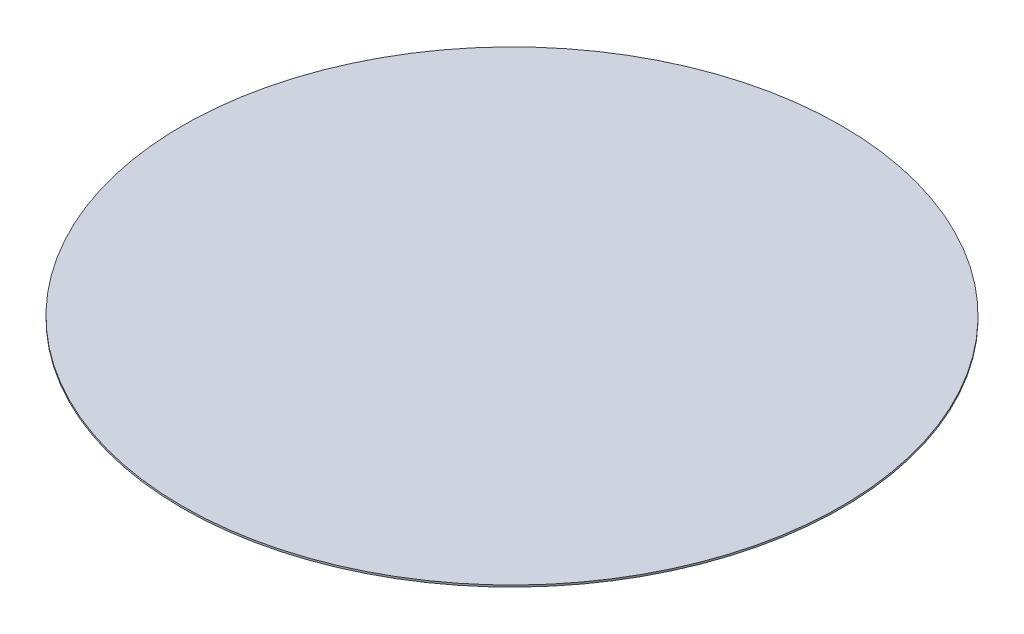
ISO-10303-21;
HEADER;
FILE_DESCRIPTION(('STEP AP214'),'2;1');
FILE_NAME('part.step','',(''),(''),'','','');
FILE_SCHEMA(('AUTOMOTIVE_DESIGN { 1 0 10303 214 1 1 1 1 }'));
ENDSEC;
DATA;
#1=APPLICATION_CONTEXT('core data for automotive mechanical design processes');
#2=APPLICATION_PROTOCOL_DEFINITION('international standard','automotive_design',2000,#1);
#3=PRODUCT_CONTEXT('',#1,'mechanical');
#4=PRODUCT('Part','Part','',(#3));
#5=PRODUCT_RELATED_PRODUCT_CATEGORY('part','',(#4));
#6=PRODUCT_DEFINITION_FORMATION('','',#4);
#7=PRODUCT_DEFINITION_CONTEXT('part definition',#1,'design');
#8=PRODUCT_DEFINITION('design','',#6,#7);
#9=PRODUCT_DEFINITION_SHAPE('','',#8);
#10=(LENGTH_UNIT() NAMED_UNIT(*) SI_UNIT(.MILLI.,.METRE.));
#11=(NAMED_UNIT(*) PLANE_ANGLE_UNIT() SI_UNIT($,.RADIAN.));
#12=(NAMED_UNIT(*) SI_UNIT($,.STERADIAN.) SOLID_ANGLE_UNIT());
#13=UNCERTAINTY_MEASURE_WITH_UNIT(LENGTH_MEASURE(1.E-05),#10,'distance_accuracy_value','');
#14=(GEOMETRIC_REPRESENTATION_CONTEXT(3) GLOBAL_UNCERTAINTY_ASSIGNED_CONTEXT((#13)) GLOBAL_UNIT_ASSIGNED_CONTEXT((#10,
#11,#12)) REPRESENTATION_CONTEXT('',''));
#15=CARTESIAN_POINT('',(0.,0.,0.));
#16=DIRECTION('',(0.,0.,1.));
#17=DIRECTION('',(1.,0.,0.));
#18=AXIS2_PLACEMENT_3D('',#15,#16,#17);
#19=CARTESIAN_POINT('',(0.,3.,0.));
#20=DIRECTION('',(0.,-1.,0.));
#21=DIRECTION('',(0.,0.,-1.));
#22=AXIS2_PLACEMENT_3D('',#19,#20,#21);
#23=CYLINDRICAL_SURFACE('',#22,550.);
#24=CARTESIAN_POINT('',(0.,3.,0.));
#25=DIRECTION('',(0.,1.,0.));
#26=DIRECTION('',(0.,0.,1.));
#27=AXIS2_PLACEMENT_3D('',#24,#25,#26);
#28=CIRCLE('',#27,550.);
#29=CARTESIAN_POINT('',(0.,3.,550.));
#30=VERTEX_POINT('',#29);
#31=EDGE_CURVE('E10',#30,#30,#28,.T.);
#32=ORIENTED_EDGE('',*,*,#31,.F.);
#33=EDGE_LOOP('',(#32));
#34=FACE_BOUND('',#33,.T.);
#35=CARTESIAN_POINT('',(0.,0.,0.));
#36=DIRECTION('',(0.,1.,0.));
#37=DIRECTION('',(0.,0.,1.));
#38=AXIS2_PLACEMENT_3D('',#35,#36,#37);
#39=CIRCLE('',#38,550.);
#40=CARTESIAN_POINT('',(0.,0.,550.));
#41=VERTEX_POINT('',#40);
#42=EDGE_CURVE('E34',#41,#41,#39,.T.);
#43=ORIENTED_EDGE('',*,*,#42,.T.);
#44=EDGE_LOOP('',(#43));
#45=FACE_BOUND('',#44,.T.);
#46=ADVANCED_FACE('F31',(#34,#45),#23,.T.);
#47=CARTESIAN_POINT('',(0.,3.,0.));
#48=DIRECTION('',(0.,1.,0.));
#49=DIRECTION('',(0.,0.,1.));
#50=AXIS2_PLACEMENT_3D('',#47,#48,#49);
#51=PLANE('',#50);
#52=ORIENTED_EDGE('',*,*,#31,.T.);
#53=EDGE_LOOP('',(#52));
#54=FACE_BOUND('',#53,.T.);
#55=ADVANCED_FACE('F46',(#54),#51,.T.);
#56=CARTESIAN_POINT('',(0.,0.,0.));
#57=DIRECTION('',(0.,1.,0.));
#58=DIRECTION('',(0.,0.,1.));
#59=AXIS2_PLACEMENT_3D('',#56,#57,#58);
#60=PLANE('',#59);
#61=ORIENTED_EDGE('',*,*,#42,.F.);
#62=EDGE_LOOP('',(#61));
#63=FACE_BOUND('',#62,.T.);
#64=ADVANCED_FACE('F44',(#63),#60,.F.);
#65=CLOSED_SHELL('',(#46,#55,#64));
#66=MANIFOLD_SOLID_BREP('B2',#65);
#67=ADVANCED_BREP_SHAPE_REPRESENTATION('',(#18,#66),#14);
#68=SHAPE_DEFINITION_REPRESENTATION(#9,#67);
ENDSEC;
END-ISO-10303-21;
